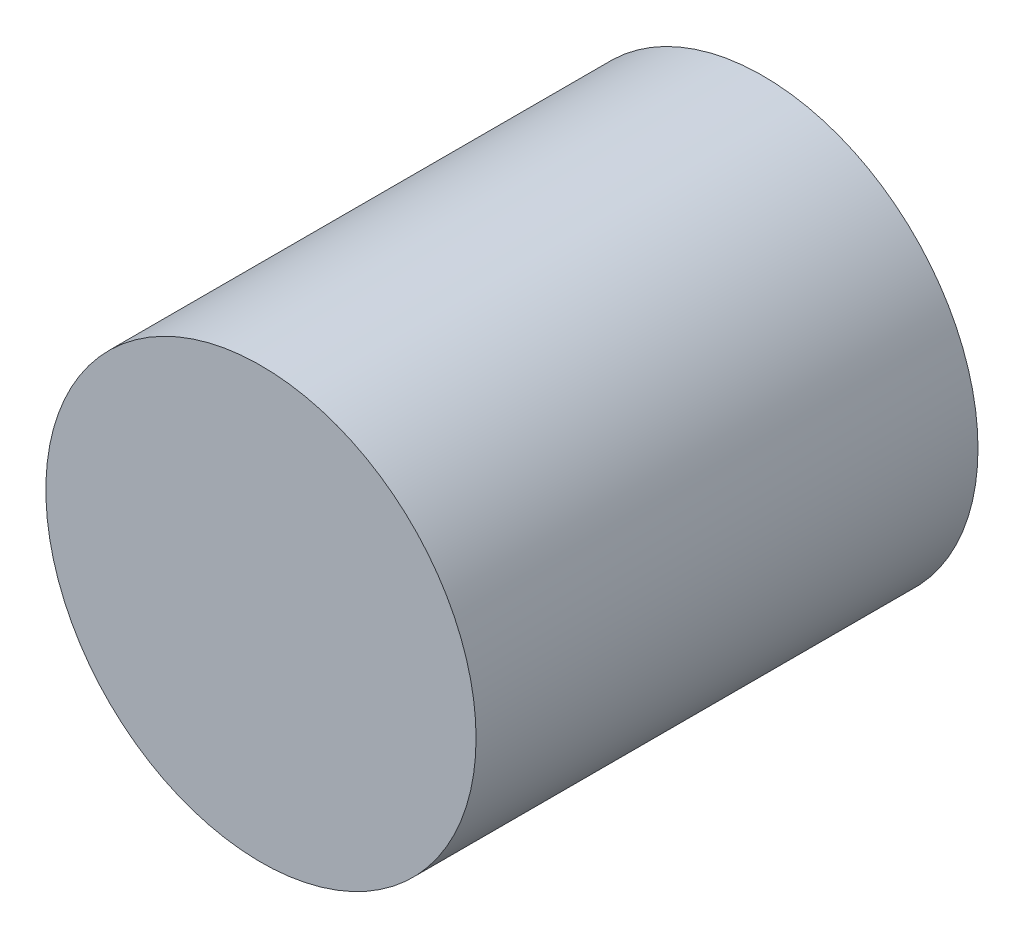
ISO-10303-21;
HEADER;
FILE_DESCRIPTION(('STEP AP214'),'2;1');
FILE_NAME('part.step','',(''),(''),'','','');
FILE_SCHEMA(('AUTOMOTIVE_DESIGN { 1 0 10303 214 1 1 1 1 }'));
ENDSEC;
DATA;
#1=APPLICATION_CONTEXT('core data for automotive mechanical design processes');
#2=APPLICATION_PROTOCOL_DEFINITION('international standard','automotive_design',2000,#1);
#3=PRODUCT_CONTEXT('',#1,'mechanical');
#4=PRODUCT('Part','Part','',(#3));
#5=PRODUCT_RELATED_PRODUCT_CATEGORY('part','',(#4));
#6=PRODUCT_DEFINITION_FORMATION('','',#4);
#7=PRODUCT_DEFINITION_CONTEXT('part definition',#1,'design');
#8=PRODUCT_DEFINITION('design','',#6,#7);
#9=PRODUCT_DEFINITION_SHAPE('','',#8);
#10=(LENGTH_UNIT() NAMED_UNIT(*) SI_UNIT(.MILLI.,.METRE.));
#11=(NAMED_UNIT(*) PLANE_ANGLE_UNIT() SI_UNIT($,.RADIAN.));
#12=(NAMED_UNIT(*) SI_UNIT($,.STERADIAN.) SOLID_ANGLE_UNIT());
#13=UNCERTAINTY_MEASURE_WITH_UNIT(LENGTH_MEASURE(1.E-05),#10,'distance_accuracy_value','');
#14=(GEOMETRIC_REPRESENTATION_CONTEXT(3) GLOBAL_UNCERTAINTY_ASSIGNED_CONTEXT((#13)) GLOBAL_UNIT_ASSIGNED_CONTEXT((#10,
#11,#12)) REPRESENTATION_CONTEXT('',''));
#15=CARTESIAN_POINT('',(0.,0.,0.));
#16=DIRECTION('',(0.,0.,1.));
#17=DIRECTION('',(1.,0.,0.));
#18=AXIS2_PLACEMENT_3D('',#15,#16,#17);
#19=CARTESIAN_POINT('',(0.,0.,210.));
#20=DIRECTION('',(0.,0.,-1.));
#21=DIRECTION('',(-1.,0.,0.));
#22=AXIS2_PLACEMENT_3D('',#19,#20,#21);
#23=CYLINDRICAL_SURFACE('',#22,90.);
#24=CARTESIAN_POINT('',(0.,0.,210.));
#25=DIRECTION('',(0.,0.,1.));
#26=DIRECTION('',(1.,0.,0.));
#27=AXIS2_PLACEMENT_3D('',#24,#25,#26);
#28=CIRCLE('',#27,90.);
#29=CARTESIAN_POINT('',(90.,0.,210.));
#30=VERTEX_POINT('',#29);
#31=EDGE_CURVE('E10',#30,#30,#28,.T.);
#32=ORIENTED_EDGE('',*,*,#31,.F.);
#33=EDGE_LOOP('',(#32));
#34=FACE_BOUND('',#33,.T.);
#35=CARTESIAN_POINT('',(0.,0.,0.));
#36=DIRECTION('',(0.,0.,1.));
#37=DIRECTION('',(1.,0.,0.));
#38=AXIS2_PLACEMENT_3D('',#35,#36,#37);
#39=CIRCLE('',#38,90.);
#40=CARTESIAN_POINT('',(90.,0.,0.));
#41=VERTEX_POINT('',#40);
#42=EDGE_CURVE('E18',#41,#41,#39,.T.);
#43=ORIENTED_EDGE('',*,*,#42,.T.);
#44=EDGE_LOOP('',(#43));
#45=FACE_BOUND('',#44,.T.);
#46=ADVANCED_FACE('F15',(#34,#45),#23,.T.);
#47=CARTESIAN_POINT('',(0.,0.,210.));
#48=DIRECTION('',(0.,0.,1.));
#49=DIRECTION('',(1.,0.,0.));
#50=AXIS2_PLACEMENT_3D('',#47,#48,#49);
#51=PLANE('',#50);
#52=ORIENTED_EDGE('',*,*,#31,.T.);
#53=EDGE_LOOP('',(#52));
#54=FACE_BOUND('',#53,.T.);
#55=ADVANCED_FACE('F36',(#54),#51,.T.);
#56=CARTESIAN_POINT('',(0.,0.,0.));
#57=DIRECTION('',(0.,0.,1.));
#58=DIRECTION('',(1.,0.,0.));
#59=AXIS2_PLACEMENT_3D('',#56,#57,#58);
#60=PLANE('',#59);
#61=ORIENTED_EDGE('',*,*,#42,.F.);
#62=EDGE_LOOP('',(#61));
#63=FACE_BOUND('',#62,.T.);
#64=ADVANCED_FACE('F34',(#63),#60,.F.);
#65=CLOSED_SHELL('',(#46,#55,#64));
#66=MANIFOLD_SOLID_BREP('B1',#65);
#67=ADVANCED_BREP_SHAPE_REPRESENTATION('',(#18,#66),#14);
#68=SHAPE_DEFINITION_REPRESENTATION(#9,#67);
ENDSEC;
END-ISO-10303-21;
